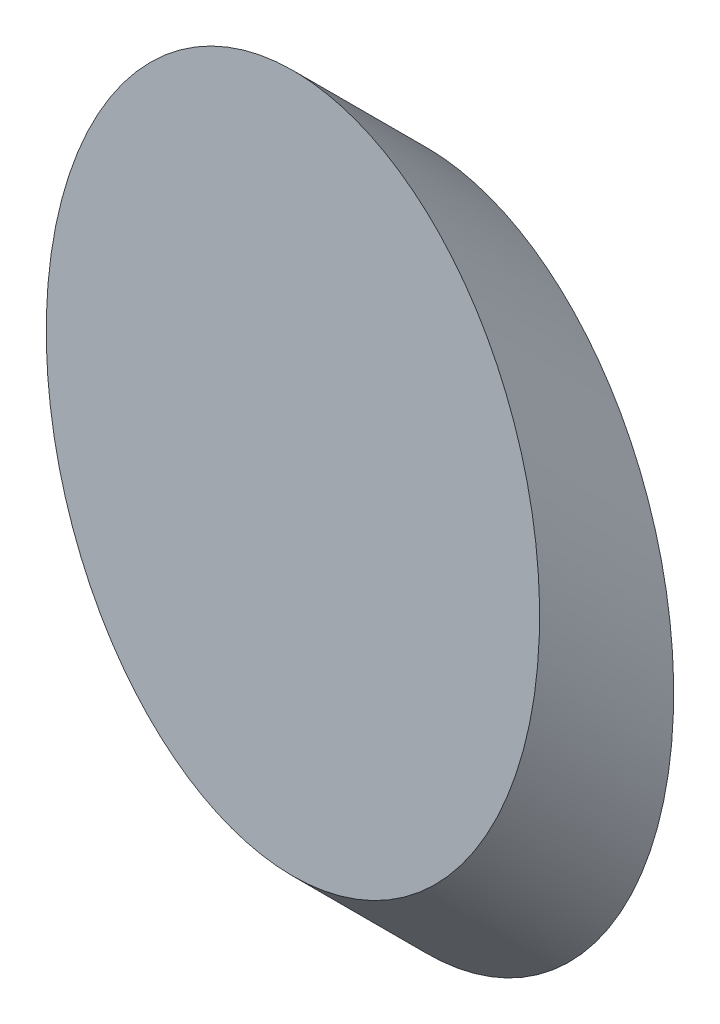
ISO-10303-21;
HEADER;
FILE_DESCRIPTION(('STEP AP214'),'2;1');
FILE_NAME('part.step','',(''),(''),'','','');
FILE_SCHEMA(('AUTOMOTIVE_DESIGN { 1 0 10303 214 1 1 1 1 }'));
ENDSEC;
DATA;
#1=APPLICATION_CONTEXT('core data for automotive mechanical design processes');
#2=APPLICATION_PROTOCOL_DEFINITION('international standard','automotive_design',2000,#1);
#3=PRODUCT_CONTEXT('',#1,'mechanical');
#4=PRODUCT('Part','Part','',(#3));
#5=PRODUCT_RELATED_PRODUCT_CATEGORY('part','',(#4));
#6=PRODUCT_DEFINITION_FORMATION('','',#4);
#7=PRODUCT_DEFINITION_CONTEXT('part definition',#1,'design');
#8=PRODUCT_DEFINITION('design','',#6,#7);
#9=PRODUCT_DEFINITION_SHAPE('','',#8);
#10=(LENGTH_UNIT() NAMED_UNIT(*) SI_UNIT(.MILLI.,.METRE.));
#11=(NAMED_UNIT(*) PLANE_ANGLE_UNIT() SI_UNIT($,.RADIAN.));
#12=(NAMED_UNIT(*) SI_UNIT($,.STERADIAN.) SOLID_ANGLE_UNIT());
#13=UNCERTAINTY_MEASURE_WITH_UNIT(LENGTH_MEASURE(1.E-05),#10,'distance_accuracy_value','');
#14=(GEOMETRIC_REPRESENTATION_CONTEXT(3) GLOBAL_UNCERTAINTY_ASSIGNED_CONTEXT((#13)) GLOBAL_UNIT_ASSIGNED_CONTEXT((#10,
#11,#12)) REPRESENTATION_CONTEXT('',''));
#15=CARTESIAN_POINT('',(0.,0.,0.));
#16=DIRECTION('',(0.,0.,1.));
#17=DIRECTION('',(1.,0.,0.));
#18=AXIS2_PLACEMENT_3D('',#15,#16,#17);
#19=CARTESIAN_POINT('',(54.3923829817161,48.2905194217003,12.5016478913781));
#20=DIRECTION('',(0.,0.,1.));
#21=DIRECTION('',(0.,1.,0.));
#22=AXIS2_PLACEMENT_3D('',#19,#20,#21);
#23=ELLIPSE('',#22,32.53,23.);
#24=DIRECTION('',(0.,-0.707106781186549,-0.707106781186546));
#25=VECTOR('',#24,1.);
#26=SURFACE_OF_LINEAR_EXTRUSION('',#23,#25);
#27=CARTESIAN_POINT('',(54.3923829817161,80.8205194217003,12.5016478913781));
#28=VERTEX_POINT('',#27);
#29=EDGE_CURVE('E10',#28,#28,#23,.T.);
#30=ORIENTED_EDGE('',*,*,#29,.F.);
#31=EDGE_LOOP('',(#30));
#32=FACE_BOUND('',#31,.T.);
#33=CARTESIAN_POINT('',(54.3923829817161,35.7888715303221,0.));
#34=DIRECTION('',(0.,0.,1.));
#35=DIRECTION('',(0.,1.,0.));
#36=AXIS2_PLACEMENT_3D('',#33,#34,#35);
#37=ELLIPSE('',#36,32.53,23.);
#38=CARTESIAN_POINT('',(54.3923829817161,68.3188715303221,0.));
#39=VERTEX_POINT('',#38);
#40=EDGE_CURVE('E39',#39,#39,#37,.T.);
#41=ORIENTED_EDGE('',*,*,#40,.T.);
#42=EDGE_LOOP('',(#41));
#43=FACE_BOUND('',#42,.T.);
#44=ADVANCED_FACE('F35',(#32,#43),#26,.F.);
#45=CARTESIAN_POINT('',(54.3923829817161,48.2905194217003,12.5016478913781));
#46=DIRECTION('',(0.,0.,1.));
#47=DIRECTION('',(1.,0.,0.));
#48=AXIS2_PLACEMENT_3D('',#45,#46,#47);
#49=PLANE('',#48);
#50=ORIENTED_EDGE('',*,*,#29,.T.);
#51=EDGE_LOOP('',(#50));
#52=FACE_BOUND('',#51,.T.);
#53=ADVANCED_FACE('F51',(#52),#49,.T.);
#54=CARTESIAN_POINT('',(54.3923829817161,35.7888715303221,0.));
#55=DIRECTION('',(0.,0.,1.));
#56=DIRECTION('',(1.,0.,0.));
#57=AXIS2_PLACEMENT_3D('',#54,#55,#56);
#58=PLANE('',#57);
#59=ORIENTED_EDGE('',*,*,#40,.F.);
#60=EDGE_LOOP('',(#59));
#61=FACE_BOUND('',#60,.T.);
#62=ADVANCED_FACE('F49',(#61),#58,.F.);
#63=CLOSED_SHELL('',(#44,#53,#62));
#64=MANIFOLD_SOLID_BREP('B2',#63);
#65=ADVANCED_BREP_SHAPE_REPRESENTATION('',(#18,#64),#14);
#66=SHAPE_DEFINITION_REPRESENTATION(#9,#65);
ENDSEC;
END-ISO-10303-21;
